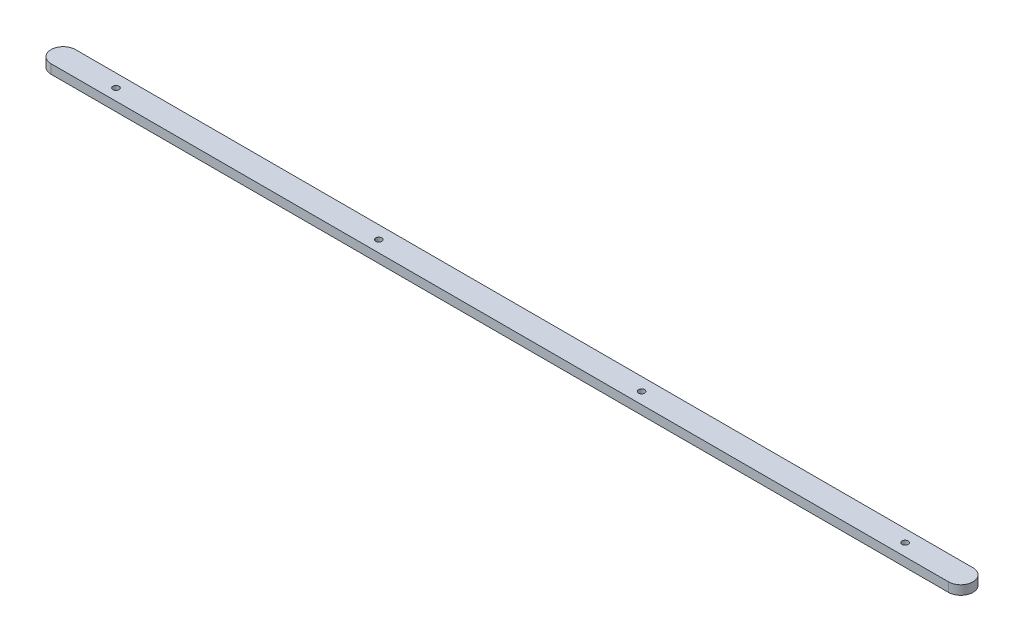
ISO-10303-21;
HEADER;
FILE_DESCRIPTION(('STEP AP214'),'2;1');
FILE_NAME('part.step','',(''),(''),'','','');
FILE_SCHEMA(('AUTOMOTIVE_DESIGN { 1 0 10303 214 1 1 1 1 }'));
ENDSEC;
DATA;
#1=APPLICATION_CONTEXT('core data for automotive mechanical design processes');
#2=APPLICATION_PROTOCOL_DEFINITION('international standard','automotive_design',2000,#1);
#3=PRODUCT_CONTEXT('',#1,'mechanical');
#4=PRODUCT('Part','Part','',(#3));
#5=PRODUCT_RELATED_PRODUCT_CATEGORY('part','',(#4));
#6=PRODUCT_DEFINITION_FORMATION('','',#4);
#7=PRODUCT_DEFINITION_CONTEXT('part definition',#1,'design');
#8=PRODUCT_DEFINITION('design','',#6,#7);
#9=PRODUCT_DEFINITION_SHAPE('','',#8);
#10=(LENGTH_UNIT() NAMED_UNIT(*) SI_UNIT(.MILLI.,.METRE.));
#11=(NAMED_UNIT(*) PLANE_ANGLE_UNIT() SI_UNIT($,.RADIAN.));
#12=(NAMED_UNIT(*) SI_UNIT($,.STERADIAN.) SOLID_ANGLE_UNIT());
#13=UNCERTAINTY_MEASURE_WITH_UNIT(LENGTH_MEASURE(1.E-05),#10,'distance_accuracy_value','');
#14=(GEOMETRIC_REPRESENTATION_CONTEXT(3) GLOBAL_UNCERTAINTY_ASSIGNED_CONTEXT((#13)) GLOBAL_UNIT_ASSIGNED_CONTEXT((#10,
#11,#12)) REPRESENTATION_CONTEXT('',''));
#15=CARTESIAN_POINT('',(0.,0.,0.));
#16=DIRECTION('',(0.,0.,1.));
#17=DIRECTION('',(1.,0.,0.));
#18=AXIS2_PLACEMENT_3D('',#15,#16,#17);
#19=CARTESIAN_POINT('',(-146.345646623093,3.,3.36018917937766));
#20=DIRECTION('',(0.,1.,0.));
#21=DIRECTION('',(0.,0.,1.));
#22=AXIS2_PLACEMENT_3D('',#19,#20,#21);
#23=PLANE('',#22);
#24=CARTESIAN_POINT('',(43.1543533769067,3.,3.61018917937767));
#25=DIRECTION('',(0.,1.,0.));
#26=DIRECTION('',(0.,0.,1.));
#27=AXIS2_PLACEMENT_3D('',#24,#25,#26);
#28=CIRCLE('',#27,1.);
#29=CARTESIAN_POINT('',(43.1543533769067,3.,4.61018917937767));
#30=VERTEX_POINT('',#29);
#31=EDGE_CURVE('E137',#30,#30,#28,.T.);
#32=ORIENTED_EDGE('',*,*,#31,.F.);
#33=EDGE_LOOP('',(#32));
#34=FACE_BOUND('',#33,.T.);
#35=CARTESIAN_POINT('',(-128.845646623093,3.,3.61018917937767));
#36=DIRECTION('',(0.,1.,0.));
#37=DIRECTION('',(0.,0.,1.));
#38=AXIS2_PLACEMENT_3D('',#35,#36,#37);
#39=CIRCLE('',#38,1.);
#40=CARTESIAN_POINT('',(-128.845646623093,3.,4.61018917937767));
#41=VERTEX_POINT('',#40);
#42=EDGE_CURVE('E103',#41,#41,#39,.T.);
#43=ORIENTED_EDGE('',*,*,#42,.F.);
#44=EDGE_LOOP('',(#43));
#45=FACE_BOUND('',#44,.T.);
#46=CARTESIAN_POINT('',(-146.345646623093,3.,3.36018917937766));
#47=DIRECTION('',(0.,1.,0.));
#48=DIRECTION('',(0.,0.,1.));
#49=AXIS2_PLACEMENT_3D('',#46,#47,#48);
#50=CIRCLE('',#49,4.);
#51=CARTESIAN_POINT('',(-146.345646623093,3.,-0.639810820622339));
#52=VERTEX_POINT('',#51);
#53=CARTESIAN_POINT('',(-146.345646623093,3.,7.36018917937767));
#54=VERTEX_POINT('',#53);
#55=EDGE_CURVE('E82',#52,#54,#50,.T.);
#56=ORIENTED_EDGE('',*,*,#55,.T.);
#57=DIRECTION('',(1.,0.,0.));
#58=VECTOR('',#57,1.);
#59=CARTESIAN_POINT('',(-146.345646623093,3.,7.36018917937767));
#60=LINE('',#59,#58);
#61=CARTESIAN_POINT('',(147.353703376907,3.,7.36018917937767));
#62=VERTEX_POINT('',#61);
#63=EDGE_CURVE('E85',#54,#62,#60,.T.);
#64=ORIENTED_EDGE('',*,*,#63,.T.);
#65=CARTESIAN_POINT('',(147.353703376907,3.,3.36018917937766));
#66=DIRECTION('',(0.,1.,0.));
#67=DIRECTION('',(0.,0.,1.));
#68=AXIS2_PLACEMENT_3D('',#65,#66,#67);
#69=CIRCLE('',#68,4.);
#70=CARTESIAN_POINT('',(147.353703376907,3.,-0.639810820622339));
#71=VERTEX_POINT('',#70);
#72=EDGE_CURVE('E89',#62,#71,#69,.T.);
#73=ORIENTED_EDGE('',*,*,#72,.T.);
#74=DIRECTION('',(-1.,0.,0.));
#75=VECTOR('',#74,1.);
#76=CARTESIAN_POINT('',(147.353703376907,3.,-0.639810820622339));
#77=LINE('',#76,#75);
#78=EDGE_CURVE('E54',#71,#52,#77,.T.);
#79=ORIENTED_EDGE('',*,*,#78,.T.);
#80=EDGE_LOOP('',(#56,#64,#73,#79));
#81=FACE_BOUND('',#80,.T.);
#82=CARTESIAN_POINT('',(-42.8456466230933,3.,3.61018917937767));
#83=DIRECTION('',(0.,1.,0.));
#84=DIRECTION('',(0.,0.,1.));
#85=AXIS2_PLACEMENT_3D('',#82,#83,#84);
#86=CIRCLE('',#85,1.);
#87=CARTESIAN_POINT('',(-42.8456466230933,3.,4.61018917937767));
#88=VERTEX_POINT('',#87);
#89=EDGE_CURVE('E141',#88,#88,#86,.T.);
#90=ORIENTED_EDGE('',*,*,#89,.F.);
#91=EDGE_LOOP('',(#90));
#92=FACE_BOUND('',#91,.T.);
#93=CARTESIAN_POINT('',(129.154353376907,3.,3.36018917937766));
#94=DIRECTION('',(0.,1.,0.));
#95=DIRECTION('',(0.,0.,1.));
#96=AXIS2_PLACEMENT_3D('',#93,#94,#95);
#97=CIRCLE('',#96,1.);
#98=CARTESIAN_POINT('',(129.154353376907,3.,4.36018917937767));
#99=VERTEX_POINT('',#98);
#100=EDGE_CURVE('E132',#99,#99,#97,.T.);
#101=ORIENTED_EDGE('',*,*,#100,.F.);
#102=EDGE_LOOP('',(#101));
#103=FACE_BOUND('',#102,.T.);
#104=ADVANCED_FACE('F37',(#34,#45,#81,#92,#103),#23,.T.);
#105=CARTESIAN_POINT('',(-146.345646623093,0.,3.36018917937766));
#106=DIRECTION('',(0.,1.,0.));
#107=DIRECTION('',(0.,0.,1.));
#108=AXIS2_PLACEMENT_3D('',#105,#106,#107);
#109=PLANE('',#108);
#110=CARTESIAN_POINT('',(-146.345646623093,0.,3.36018917937766));
#111=DIRECTION('',(0.,1.,0.));
#112=DIRECTION('',(0.,0.,1.));
#113=AXIS2_PLACEMENT_3D('',#110,#111,#112);
#114=CIRCLE('',#113,4.);
#115=CARTESIAN_POINT('',(-146.345646623093,0.,-0.639810820622339));
#116=VERTEX_POINT('',#115);
#117=CARTESIAN_POINT('',(-146.345646623093,0.,7.36018917937767));
#118=VERTEX_POINT('',#117);
#119=EDGE_CURVE('E77',#116,#118,#114,.T.);
#120=ORIENTED_EDGE('',*,*,#119,.F.);
#121=DIRECTION('',(-1.,0.,0.));
#122=VECTOR('',#121,1.);
#123=CARTESIAN_POINT('',(147.353703376907,0.,-0.639810820622339));
#124=LINE('',#123,#122);
#125=CARTESIAN_POINT('',(147.353703376907,0.,-0.639810820622339));
#126=VERTEX_POINT('',#125);
#127=EDGE_CURVE('E106',#126,#116,#124,.T.);
#128=ORIENTED_EDGE('',*,*,#127,.F.);
#129=CARTESIAN_POINT('',(147.353703376907,0.,3.36018917937766));
#130=DIRECTION('',(0.,1.,0.));
#131=DIRECTION('',(0.,0.,1.));
#132=AXIS2_PLACEMENT_3D('',#129,#130,#131);
#133=CIRCLE('',#132,4.);
#134=CARTESIAN_POINT('',(147.353703376907,0.,7.36018917937767));
#135=VERTEX_POINT('',#134);
#136=EDGE_CURVE('E70',#135,#126,#133,.T.);
#137=ORIENTED_EDGE('',*,*,#136,.F.);
#138=DIRECTION('',(1.,0.,0.));
#139=VECTOR('',#138,1.);
#140=CARTESIAN_POINT('',(-146.345646623093,0.,7.36018917937767));
#141=LINE('',#140,#139);
#142=EDGE_CURVE('E94',#118,#135,#141,.T.);
#143=ORIENTED_EDGE('',*,*,#142,.F.);
#144=EDGE_LOOP('',(#120,#128,#137,#143));
#145=FACE_BOUND('',#144,.T.);
#146=CARTESIAN_POINT('',(-128.845646623093,0.,3.61018917937767));
#147=DIRECTION('',(0.,1.,0.));
#148=DIRECTION('',(0.,0.,1.));
#149=AXIS2_PLACEMENT_3D('',#146,#147,#148);
#150=CIRCLE('',#149,1.);
#151=CARTESIAN_POINT('',(-128.845646623093,0.,4.61018917937767));
#152=VERTEX_POINT('',#151);
#153=EDGE_CURVE('E119',#152,#152,#150,.T.);
#154=ORIENTED_EDGE('',*,*,#153,.T.);
#155=EDGE_LOOP('',(#154));
#156=FACE_BOUND('',#155,.T.);
#157=CARTESIAN_POINT('',(-42.8456466230933,0.,3.61018917937767));
#158=DIRECTION('',(0.,1.,0.));
#159=DIRECTION('',(0.,0.,1.));
#160=AXIS2_PLACEMENT_3D('',#157,#158,#159);
#161=CIRCLE('',#160,1.);
#162=CARTESIAN_POINT('',(-42.8456466230933,0.,4.61018917937767));
#163=VERTEX_POINT('',#162);
#164=EDGE_CURVE('E123',#163,#163,#161,.T.);
#165=ORIENTED_EDGE('',*,*,#164,.T.);
#166=EDGE_LOOP('',(#165));
#167=FACE_BOUND('',#166,.T.);
#168=CARTESIAN_POINT('',(43.1543533769067,0.,3.61018917937767));
#169=DIRECTION('',(0.,1.,0.));
#170=DIRECTION('',(0.,0.,1.));
#171=AXIS2_PLACEMENT_3D('',#168,#169,#170);
#172=CIRCLE('',#171,1.);
#173=CARTESIAN_POINT('',(43.1543533769067,0.,4.61018917937767));
#174=VERTEX_POINT('',#173);
#175=EDGE_CURVE('E127',#174,#174,#172,.T.);
#176=ORIENTED_EDGE('',*,*,#175,.T.);
#177=EDGE_LOOP('',(#176));
#178=FACE_BOUND('',#177,.T.);
#179=CARTESIAN_POINT('',(129.154353376907,0.,3.36018917937766));
#180=DIRECTION('',(0.,1.,0.));
#181=DIRECTION('',(0.,0.,1.));
#182=AXIS2_PLACEMENT_3D('',#179,#180,#181);
#183=CIRCLE('',#182,1.);
#184=CARTESIAN_POINT('',(129.154353376907,0.,4.36018917937767));
#185=VERTEX_POINT('',#184);
#186=EDGE_CURVE('E130',#185,#185,#183,.T.);
#187=ORIENTED_EDGE('',*,*,#186,.T.);
#188=EDGE_LOOP('',(#187));
#189=FACE_BOUND('',#188,.T.);
#190=ADVANCED_FACE('F112',(#145,#156,#167,#178,#189),#109,.F.);
#191=CARTESIAN_POINT('',(-146.345646623093,3.,3.36018917937766));
#192=DIRECTION('',(0.,-1.,0.));
#193=DIRECTION('',(0.,0.,-1.));
#194=AXIS2_PLACEMENT_3D('',#191,#192,#193);
#195=CYLINDRICAL_SURFACE('',#194,4.);
#196=ORIENTED_EDGE('',*,*,#119,.T.);
#197=DIRECTION('',(0.,-1.,0.));
#198=VECTOR('',#197,1.);
#199=CARTESIAN_POINT('',(-146.345646623093,3.,7.36018917937767));
#200=LINE('',#199,#198);
#201=EDGE_CURVE('E11',#54,#118,#200,.T.);
#202=ORIENTED_EDGE('',*,*,#201,.F.);
#203=ORIENTED_EDGE('',*,*,#55,.F.);
#204=DIRECTION('',(0.,-1.,0.));
#205=VECTOR('',#204,1.);
#206=CARTESIAN_POINT('',(-146.345646623093,3.,-0.639810820622339));
#207=LINE('',#206,#205);
#208=EDGE_CURVE('E98',#52,#116,#207,.T.);
#209=ORIENTED_EDGE('',*,*,#208,.T.);
#210=EDGE_LOOP('',(#196,#202,#203,#209));
#211=FACE_BOUND('',#210,.T.);
#212=ADVANCED_FACE('F39',(#211),#195,.T.);
#213=CARTESIAN_POINT('',(-146.345646623093,3.,7.36018917937767));
#214=DIRECTION('',(0.,0.,-1.));
#215=DIRECTION('',(-1.,0.,0.));
#216=AXIS2_PLACEMENT_3D('',#213,#214,#215);
#217=PLANE('',#216);
#218=ORIENTED_EDGE('',*,*,#142,.T.);
#219=DIRECTION('',(0.,-1.,0.));
#220=VECTOR('',#219,1.);
#221=CARTESIAN_POINT('',(147.353703376907,3.,7.36018917937767));
#222=LINE('',#221,#220);
#223=EDGE_CURVE('E46',#62,#135,#222,.T.);
#224=ORIENTED_EDGE('',*,*,#223,.F.);
#225=ORIENTED_EDGE('',*,*,#63,.F.);
#226=ORIENTED_EDGE('',*,*,#201,.T.);
#227=EDGE_LOOP('',(#218,#224,#225,#226));
#228=FACE_BOUND('',#227,.T.);
#229=ADVANCED_FACE('F93',(#228),#217,.F.);
#230=CARTESIAN_POINT('',(147.353703376907,3.,3.36018917937766));
#231=DIRECTION('',(0.,-1.,0.));
#232=DIRECTION('',(0.,0.,-1.));
#233=AXIS2_PLACEMENT_3D('',#230,#231,#232);
#234=CYLINDRICAL_SURFACE('',#233,4.);
#235=ORIENTED_EDGE('',*,*,#136,.T.);
#236=DIRECTION('',(0.,-1.,0.));
#237=VECTOR('',#236,1.);
#238=CARTESIAN_POINT('',(147.353703376907,3.,-0.639810820622339));
#239=LINE('',#238,#237);
#240=EDGE_CURVE('E95',#71,#126,#239,.T.);
#241=ORIENTED_EDGE('',*,*,#240,.F.);
#242=ORIENTED_EDGE('',*,*,#72,.F.);
#243=ORIENTED_EDGE('',*,*,#223,.T.);
#244=EDGE_LOOP('',(#235,#241,#242,#243));
#245=FACE_BOUND('',#244,.T.);
#246=ADVANCED_FACE('F96',(#245),#234,.T.);
#247=CARTESIAN_POINT('',(147.353703376907,3.,-0.639810820622339));
#248=DIRECTION('',(0.,0.,1.));
#249=DIRECTION('',(1.,0.,0.));
#250=AXIS2_PLACEMENT_3D('',#247,#248,#249);
#251=PLANE('',#250);
#252=ORIENTED_EDGE('',*,*,#127,.T.);
#253=ORIENTED_EDGE('',*,*,#208,.F.);
#254=ORIENTED_EDGE('',*,*,#78,.F.);
#255=ORIENTED_EDGE('',*,*,#240,.T.);
#256=EDGE_LOOP('',(#252,#253,#254,#255));
#257=FACE_BOUND('',#256,.T.);
#258=ADVANCED_FACE('F111',(#257),#251,.F.);
#259=CARTESIAN_POINT('',(-128.845646623093,3.,3.61018917937767));
#260=DIRECTION('',(0.,-1.,0.));
#261=DIRECTION('',(0.,0.,-1.));
#262=AXIS2_PLACEMENT_3D('',#259,#260,#261);
#263=CYLINDRICAL_SURFACE('',#262,1.);
#264=ORIENTED_EDGE('',*,*,#42,.T.);
#265=EDGE_LOOP('',(#264));
#266=FACE_BOUND('',#265,.T.);
#267=ORIENTED_EDGE('',*,*,#153,.F.);
#268=EDGE_LOOP('',(#267));
#269=FACE_BOUND('',#268,.T.);
#270=ADVANCED_FACE('F149',(#266,#269),#263,.F.);
#271=CARTESIAN_POINT('',(-42.8456466230933,3.,3.61018917937767));
#272=DIRECTION('',(0.,-1.,0.));
#273=DIRECTION('',(0.,0.,-1.));
#274=AXIS2_PLACEMENT_3D('',#271,#272,#273);
#275=CYLINDRICAL_SURFACE('',#274,1.);
#276=ORIENTED_EDGE('',*,*,#89,.T.);
#277=EDGE_LOOP('',(#276));
#278=FACE_BOUND('',#277,.T.);
#279=ORIENTED_EDGE('',*,*,#164,.F.);
#280=EDGE_LOOP('',(#279));
#281=FACE_BOUND('',#280,.T.);
#282=ADVANCED_FACE('F211',(#278,#281),#275,.F.);
#283=CARTESIAN_POINT('',(43.1543533769067,3.,3.61018917937767));
#284=DIRECTION('',(0.,-1.,0.));
#285=DIRECTION('',(0.,0.,-1.));
#286=AXIS2_PLACEMENT_3D('',#283,#284,#285);
#287=CYLINDRICAL_SURFACE('',#286,1.);
#288=ORIENTED_EDGE('',*,*,#31,.T.);
#289=EDGE_LOOP('',(#288));
#290=FACE_BOUND('',#289,.T.);
#291=ORIENTED_EDGE('',*,*,#175,.F.);
#292=EDGE_LOOP('',(#291));
#293=FACE_BOUND('',#292,.T.);
#294=ADVANCED_FACE('F218',(#290,#293),#287,.F.);
#295=CARTESIAN_POINT('',(129.154353376907,3.,3.36018917937766));
#296=DIRECTION('',(0.,-1.,0.));
#297=DIRECTION('',(0.,0.,-1.));
#298=AXIS2_PLACEMENT_3D('',#295,#296,#297);
#299=CYLINDRICAL_SURFACE('',#298,1.);
#300=ORIENTED_EDGE('',*,*,#100,.T.);
#301=EDGE_LOOP('',(#300));
#302=FACE_BOUND('',#301,.T.);
#303=ORIENTED_EDGE('',*,*,#186,.F.);
#304=EDGE_LOOP('',(#303));
#305=FACE_BOUND('',#304,.T.);
#306=ADVANCED_FACE('F226',(#302,#305),#299,.F.);
#307=CLOSED_SHELL('',(#104,#190,#212,#229,#246,#258,#270,#282,#294,#306));
#308=MANIFOLD_SOLID_BREP('B2',#307);
#309=ADVANCED_BREP_SHAPE_REPRESENTATION('',(#18,#308),#14);
#310=SHAPE_DEFINITION_REPRESENTATION(#9,#309);
ENDSEC;
END-ISO-10303-21;
